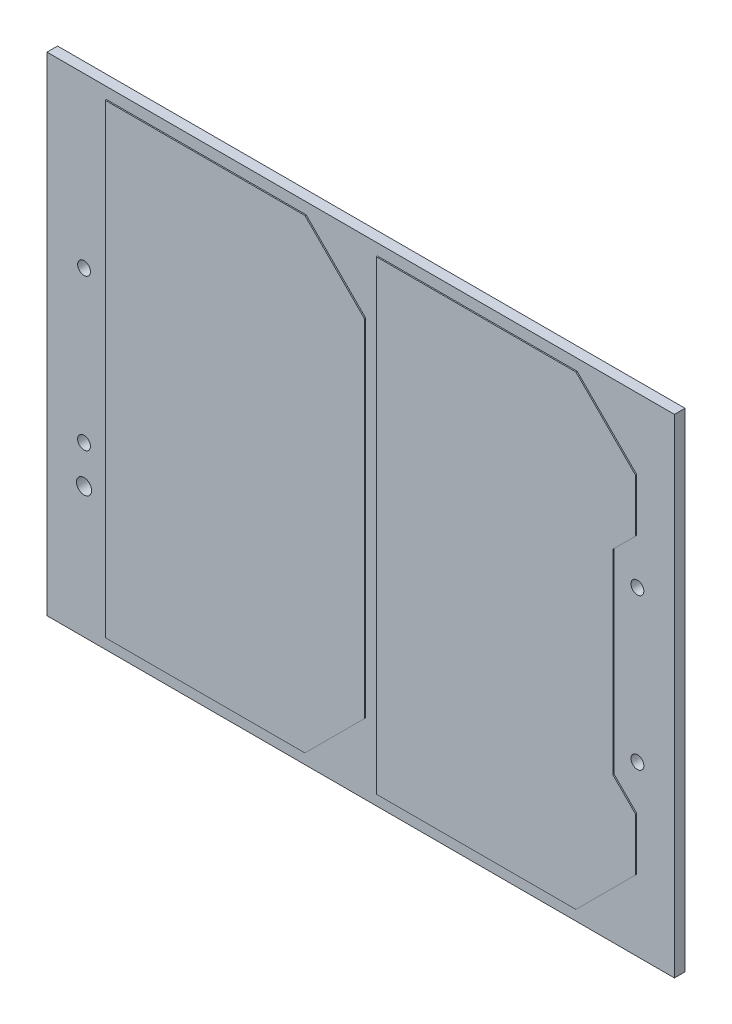
ISO-10303-21;
HEADER;
FILE_DESCRIPTION(('STEP AP214'),'2;1');
FILE_NAME('part.step','',(''),(''),'','','');
FILE_SCHEMA(('AUTOMOTIVE_DESIGN { 1 0 10303 214 1 1 1 1 }'));
ENDSEC;
DATA;
#1=APPLICATION_CONTEXT('core data for automotive mechanical design processes');
#2=APPLICATION_PROTOCOL_DEFINITION('international standard','automotive_design',2000,#1);
#3=PRODUCT_CONTEXT('',#1,'mechanical');
#4=PRODUCT('Part','Part','',(#3));
#5=PRODUCT_RELATED_PRODUCT_CATEGORY('part','',(#4));
#6=PRODUCT_DEFINITION_FORMATION('','',#4);
#7=PRODUCT_DEFINITION_CONTEXT('part definition',#1,'design');
#8=PRODUCT_DEFINITION('design','',#6,#7);
#9=PRODUCT_DEFINITION_SHAPE('','',#8);
#10=(LENGTH_UNIT() NAMED_UNIT(*) SI_UNIT(.MILLI.,.METRE.));
#11=(NAMED_UNIT(*) PLANE_ANGLE_UNIT() SI_UNIT($,.RADIAN.));
#12=(NAMED_UNIT(*) SI_UNIT($,.STERADIAN.) SOLID_ANGLE_UNIT());
#13=UNCERTAINTY_MEASURE_WITH_UNIT(LENGTH_MEASURE(1.E-05),#10,'distance_accuracy_value','');
#14=(GEOMETRIC_REPRESENTATION_CONTEXT(3) GLOBAL_UNCERTAINTY_ASSIGNED_CONTEXT((#13)) GLOBAL_UNIT_ASSIGNED_CONTEXT((#10,
#11,#12)) REPRESENTATION_CONTEXT('',''));
#15=CARTESIAN_POINT('',(0.,0.,0.));
#16=DIRECTION('',(0.,0.,1.));
#17=DIRECTION('',(1.,0.,0.));
#18=AXIS2_PLACEMENT_3D('',#15,#16,#17);
#19=CARTESIAN_POINT('',(0.,0.,1.778));
#20=DIRECTION('',(0.,0.,1.));
#21=DIRECTION('',(1.,0.,0.));
#22=AXIS2_PLACEMENT_3D('',#19,#20,#21);
#23=PLANE('',#22);
#24=CARTESIAN_POINT('',(-46.482,-19.05,1.778));
#25=DIRECTION('',(0.,0.,1.));
#26=DIRECTION('',(1.,0.,0.));
#27=AXIS2_PLACEMENT_3D('',#24,#25,#26);
#28=CIRCLE('',#27,1.27);
#29=CARTESIAN_POINT('',(-45.212,-19.05,1.778));
#30=VERTEX_POINT('',#29);
#31=EDGE_CURVE('E251',#30,#30,#28,.T.);
#32=ORIENTED_EDGE('',*,*,#31,.F.);
#33=EDGE_LOOP('',(#32));
#34=FACE_BOUND('',#33,.T.);
#35=CARTESIAN_POINT('',(-46.482,-12.7,1.778));
#36=DIRECTION('',(0.,0.,1.));
#37=DIRECTION('',(1.,0.,0.));
#38=AXIS2_PLACEMENT_3D('',#35,#36,#37);
#39=CIRCLE('',#38,1.0795);
#40=CARTESIAN_POINT('',(-45.4025,-12.7,1.778));
#41=VERTEX_POINT('',#40);
#42=EDGE_CURVE('E254',#41,#41,#39,.T.);
#43=ORIENTED_EDGE('',*,*,#42,.F.);
#44=EDGE_LOOP('',(#43));
#45=FACE_BOUND('',#44,.T.);
#46=CARTESIAN_POINT('',(-46.482,12.7,1.778));
#47=DIRECTION('',(0.,0.,1.));
#48=DIRECTION('',(1.,0.,0.));
#49=AXIS2_PLACEMENT_3D('',#46,#47,#48);
#50=CIRCLE('',#49,1.0795);
#51=CARTESIAN_POINT('',(-45.4025,12.7,1.778));
#52=VERTEX_POINT('',#51);
#53=EDGE_CURVE('E258',#52,#52,#50,.T.);
#54=ORIENTED_EDGE('',*,*,#53,.F.);
#55=EDGE_LOOP('',(#54));
#56=FACE_BOUND('',#55,.T.);
#57=CARTESIAN_POINT('',(46.482,-12.7,1.778));
#58=DIRECTION('',(0.,0.,1.));
#59=DIRECTION('',(1.,0.,0.));
#60=AXIS2_PLACEMENT_3D('',#57,#58,#59);
#61=CIRCLE('',#60,1.0795);
#62=CARTESIAN_POINT('',(47.5615,-12.7,1.778));
#63=VERTEX_POINT('',#62);
#64=EDGE_CURVE('E261',#63,#63,#61,.T.);
#65=ORIENTED_EDGE('',*,*,#64,.F.);
#66=EDGE_LOOP('',(#65));
#67=FACE_BOUND('',#66,.T.);
#68=CARTESIAN_POINT('',(46.482,12.7,1.778));
#69=DIRECTION('',(0.,0.,1.));
#70=DIRECTION('',(1.,0.,0.));
#71=AXIS2_PLACEMENT_3D('',#68,#69,#70);
#72=CIRCLE('',#71,1.0795);
#73=CARTESIAN_POINT('',(47.5615,12.7,1.778));
#74=VERTEX_POINT('',#73);
#75=EDGE_CURVE('E264',#74,#74,#72,.T.);
#76=ORIENTED_EDGE('',*,*,#75,.F.);
#77=EDGE_LOOP('',(#76));
#78=FACE_BOUND('',#77,.T.);
#79=DIRECTION('',(1.,0.,0.));
#80=VECTOR('',#79,1.);
#81=CARTESIAN_POINT('',(0.,-41.,1.778));
#82=LINE('',#81,#80);
#83=CARTESIAN_POINT('',(-52.705,-41.,1.778));
#84=VERTEX_POINT('',#83);
#85=CARTESIAN_POINT('',(52.705,-41.,1.778));
#86=VERTEX_POINT('',#85);
#87=EDGE_CURVE('E267',#84,#86,#82,.T.);
#88=ORIENTED_EDGE('',*,*,#87,.T.);
#89=DIRECTION('',(0.,1.,0.));
#90=VECTOR('',#89,1.);
#91=CARTESIAN_POINT('',(52.705,0.,1.778));
#92=LINE('',#91,#90);
#93=CARTESIAN_POINT('',(52.705,41.,1.778));
#94=VERTEX_POINT('',#93);
#95=EDGE_CURVE('E270',#86,#94,#92,.T.);
#96=ORIENTED_EDGE('',*,*,#95,.T.);
#97=DIRECTION('',(1.,0.,0.));
#98=VECTOR('',#97,1.);
#99=CARTESIAN_POINT('',(0.,41.,1.778));
#100=LINE('',#99,#98);
#101=CARTESIAN_POINT('',(-52.705,41.,1.778));
#102=VERTEX_POINT('',#101);
#103=EDGE_CURVE('E272',#102,#94,#100,.T.);
#104=ORIENTED_EDGE('',*,*,#103,.F.);
#105=DIRECTION('',(0.,1.,0.));
#106=VECTOR('',#105,1.);
#107=CARTESIAN_POINT('',(-52.705,0.,1.778));
#108=LINE('',#107,#106);
#109=EDGE_CURVE('E275',#84,#102,#108,.T.);
#110=ORIENTED_EDGE('',*,*,#109,.F.);
#111=EDGE_LOOP('',(#88,#96,#104,#110));
#112=FACE_BOUND('',#111,.T.);
#113=DIRECTION('',(1.,0.,0.));
#114=VECTOR('',#113,1.);
#115=CARTESIAN_POINT('',(-42.705,-39.095,1.778));
#116=LINE('',#115,#114);
#117=CARTESIAN_POINT('',(-42.705,-39.095,1.778));
#118=VERTEX_POINT('',#117);
#119=CARTESIAN_POINT('',(-9.17499999999998,-39.095,1.778));
#120=VERTEX_POINT('',#119);
#121=EDGE_CURVE('E207',#118,#120,#116,.T.);
#122=ORIENTED_EDGE('',*,*,#121,.F.);
#123=DIRECTION('',(0.,-1.,0.));
#124=VECTOR('',#123,1.);
#125=CARTESIAN_POINT('',(-42.705,39.095,1.778));
#126=LINE('',#125,#124);
#127=CARTESIAN_POINT('',(-42.705,39.095,1.778));
#128=VERTEX_POINT('',#127);
#129=EDGE_CURVE('E204',#128,#118,#126,.T.);
#130=ORIENTED_EDGE('',*,*,#129,.F.);
#131=DIRECTION('',(-1.,0.,0.));
#132=VECTOR('',#131,1.);
#133=CARTESIAN_POINT('',(-42.705,39.095,1.778));
#134=LINE('',#133,#132);
#135=CARTESIAN_POINT('',(-9.17499999999999,39.095,1.778));
#136=VERTEX_POINT('',#135);
#137=EDGE_CURVE('E217',#136,#128,#134,.T.);
#138=ORIENTED_EDGE('',*,*,#137,.F.);
#139=DIRECTION('',(-0.707106781186548,0.707106781186548,0.));
#140=VECTOR('',#139,1.);
#141=CARTESIAN_POINT('',(-9.17499999999999,39.095,1.778));
#142=LINE('',#141,#140);
#143=CARTESIAN_POINT('',(0.825000000000014,29.095,1.778));
#144=VERTEX_POINT('',#143);
#145=EDGE_CURVE('E233',#144,#136,#142,.T.);
#146=ORIENTED_EDGE('',*,*,#145,.F.);
#147=DIRECTION('',(0.,1.,0.));
#148=VECTOR('',#147,1.);
#149=CARTESIAN_POINT('',(0.825000000000014,29.095,1.778));
#150=LINE('',#149,#148);
#151=CARTESIAN_POINT('',(0.825000000000014,-29.095,1.778));
#152=VERTEX_POINT('',#151);
#153=EDGE_CURVE('E231',#152,#144,#150,.T.);
#154=ORIENTED_EDGE('',*,*,#153,.F.);
#155=DIRECTION('',(0.707106781186547,0.707106781186548,0.));
#156=VECTOR('',#155,1.);
#157=CARTESIAN_POINT('',(0.825000000000014,-29.095,1.778));
#158=LINE('',#157,#156);
#159=EDGE_CURVE('E229',#120,#152,#158,.T.);
#160=ORIENTED_EDGE('',*,*,#159,.F.);
#161=EDGE_LOOP('',(#122,#130,#138,#146,#154,#160));
#162=FACE_BOUND('',#161,.T.);
#163=DIRECTION('',(-0.707106781186548,0.707106781186547,0.));
#164=VECTOR('',#163,1.);
#165=CARTESIAN_POINT('',(36.355,39.095,1.778));
#166=LINE('',#165,#164);
#167=CARTESIAN_POINT('',(46.355,29.095,1.778));
#168=VERTEX_POINT('',#167);
#169=CARTESIAN_POINT('',(36.355,39.095,1.778));
#170=VERTEX_POINT('',#169);
#171=EDGE_CURVE('E602',#168,#170,#166,.T.);
#172=ORIENTED_EDGE('',*,*,#171,.F.);
#173=DIRECTION('',(0.,1.,0.));
#174=VECTOR('',#173,1.);
#175=CARTESIAN_POINT('',(46.355,29.095,1.778));
#176=LINE('',#175,#174);
#177=CARTESIAN_POINT('',(46.355,20.205,1.778));
#178=VERTEX_POINT('',#177);
#179=EDGE_CURVE('E202',#178,#168,#176,.T.);
#180=ORIENTED_EDGE('',*,*,#179,.F.);
#181=DIRECTION('',(0.707106781186549,0.707106781186546,0.));
#182=VECTOR('',#181,1.);
#183=CARTESIAN_POINT('',(46.355,20.205,1.778));
#184=LINE('',#183,#182);
#185=CARTESIAN_POINT('',(42.545,16.395,1.778));
#186=VERTEX_POINT('',#185);
#187=EDGE_CURVE('E198',#186,#178,#184,.T.);
#188=ORIENTED_EDGE('',*,*,#187,.F.);
#189=DIRECTION('',(0.,1.,0.));
#190=VECTOR('',#189,1.);
#191=CARTESIAN_POINT('',(42.545,16.395,1.778));
#192=LINE('',#191,#190);
#193=CARTESIAN_POINT('',(42.545,-16.395,1.778));
#194=VERTEX_POINT('',#193);
#195=EDGE_CURVE('E598',#194,#186,#192,.T.);
#196=ORIENTED_EDGE('',*,*,#195,.F.);
#197=DIRECTION('',(-0.707106781186548,0.707106781186547,0.));
#198=VECTOR('',#197,1.);
#199=CARTESIAN_POINT('',(42.545,-16.395,1.778));
#200=LINE('',#199,#198);
#201=CARTESIAN_POINT('',(46.355,-20.205,1.778));
#202=VERTEX_POINT('',#201);
#203=EDGE_CURVE('E618',#202,#194,#200,.T.);
#204=ORIENTED_EDGE('',*,*,#203,.F.);
#205=DIRECTION('',(0.,1.,0.));
#206=VECTOR('',#205,1.);
#207=CARTESIAN_POINT('',(46.355,-20.205,1.778));
#208=LINE('',#207,#206);
#209=CARTESIAN_POINT('',(46.355,-29.095,1.778));
#210=VERTEX_POINT('',#209);
#211=EDGE_CURVE('E616',#210,#202,#208,.T.);
#212=ORIENTED_EDGE('',*,*,#211,.F.);
#213=DIRECTION('',(0.707106781186548,0.707106781186547,0.));
#214=VECTOR('',#213,1.);
#215=CARTESIAN_POINT('',(36.355,-39.095,1.778));
#216=LINE('',#215,#214);
#217=CARTESIAN_POINT('',(36.355,-39.095,1.778));
#218=VERTEX_POINT('',#217);
#219=EDGE_CURVE('E614',#218,#210,#216,.T.);
#220=ORIENTED_EDGE('',*,*,#219,.F.);
#221=DIRECTION('',(1.,0.,0.));
#222=VECTOR('',#221,1.);
#223=CARTESIAN_POINT('',(2.82500000000001,-39.095,1.778));
#224=LINE('',#223,#222);
#225=CARTESIAN_POINT('',(2.82500000000001,-39.095,1.778));
#226=VERTEX_POINT('',#225);
#227=EDGE_CURVE('E612',#226,#218,#224,.T.);
#228=ORIENTED_EDGE('',*,*,#227,.F.);
#229=DIRECTION('',(0.,-1.,0.));
#230=VECTOR('',#229,1.);
#231=CARTESIAN_POINT('',(2.82500000000001,39.095,1.778));
#232=LINE('',#231,#230);
#233=CARTESIAN_POINT('',(2.82500000000001,39.095,1.778));
#234=VERTEX_POINT('',#233);
#235=EDGE_CURVE('E610',#234,#226,#232,.T.);
#236=ORIENTED_EDGE('',*,*,#235,.F.);
#237=DIRECTION('',(-1.,0.,0.));
#238=VECTOR('',#237,1.);
#239=CARTESIAN_POINT('',(2.82500000000001,39.095,1.778));
#240=LINE('',#239,#238);
#241=EDGE_CURVE('E604',#170,#234,#240,.T.);
#242=ORIENTED_EDGE('',*,*,#241,.F.);
#243=EDGE_LOOP('',(#172,#180,#188,#196,#204,#212,#220,#228,#236,#242));
#244=FACE_BOUND('',#243,.T.);
#245=ADVANCED_FACE('F41',(#34,#45,#56,#67,#78,#112,#162,#244),#23,.T.);
#246=CARTESIAN_POINT('',(0.,-41.,1.778));
#247=DIRECTION('',(0.,1.,0.));
#248=DIRECTION('',(0.,0.,1.));
#249=AXIS2_PLACEMENT_3D('',#246,#247,#248);
#250=PLANE('',#249);
#251=DIRECTION('',(1.,0.,0.));
#252=VECTOR('',#251,1.);
#253=CARTESIAN_POINT('',(0.,-41.,0.));
#254=LINE('',#253,#252);
#255=CARTESIAN_POINT('',(-52.705,-41.,0.));
#256=VERTEX_POINT('',#255);
#257=CARTESIAN_POINT('',(52.705,-41.,0.));
#258=VERTEX_POINT('',#257);
#259=EDGE_CURVE('E293',#256,#258,#254,.T.);
#260=ORIENTED_EDGE('',*,*,#259,.T.);
#261=DIRECTION('',(0.,0.,-1.));
#262=VECTOR('',#261,1.);
#263=CARTESIAN_POINT('',(52.705,-41.,1.778));
#264=LINE('',#263,#262);
#265=EDGE_CURVE('E11',#86,#258,#264,.T.);
#266=ORIENTED_EDGE('',*,*,#265,.F.);
#267=ORIENTED_EDGE('',*,*,#87,.F.);
#268=DIRECTION('',(0.,0.,-1.));
#269=VECTOR('',#268,1.);
#270=CARTESIAN_POINT('',(-52.705,-41.,1.778));
#271=LINE('',#270,#269);
#272=EDGE_CURVE('E278',#84,#256,#271,.T.);
#273=ORIENTED_EDGE('',*,*,#272,.T.);
#274=EDGE_LOOP('',(#260,#266,#267,#273));
#275=FACE_BOUND('',#274,.T.);
#276=ADVANCED_FACE('F325',(#275),#250,.F.);
#277=CARTESIAN_POINT('',(52.705,0.,1.778));
#278=DIRECTION('',(-1.,0.,0.));
#279=DIRECTION('',(0.,0.,1.));
#280=AXIS2_PLACEMENT_3D('',#277,#278,#279);
#281=PLANE('',#280);
#282=DIRECTION('',(0.,1.,0.));
#283=VECTOR('',#282,1.);
#284=CARTESIAN_POINT('',(52.705,0.,0.));
#285=LINE('',#284,#283);
#286=CARTESIAN_POINT('',(52.705,41.,0.));
#287=VERTEX_POINT('',#286);
#288=EDGE_CURVE('E296',#258,#287,#285,.T.);
#289=ORIENTED_EDGE('',*,*,#288,.T.);
#290=DIRECTION('',(0.,0.,-1.));
#291=VECTOR('',#290,1.);
#292=CARTESIAN_POINT('',(52.705,41.,1.778));
#293=LINE('',#292,#291);
#294=EDGE_CURVE('E49',#94,#287,#293,.T.);
#295=ORIENTED_EDGE('',*,*,#294,.F.);
#296=ORIENTED_EDGE('',*,*,#95,.F.);
#297=ORIENTED_EDGE('',*,*,#265,.T.);
#298=EDGE_LOOP('',(#289,#295,#296,#297));
#299=FACE_BOUND('',#298,.T.);
#300=ADVANCED_FACE('F312',(#299),#281,.F.);
#301=CARTESIAN_POINT('',(0.,41.,1.778));
#302=DIRECTION('',(0.,1.,0.));
#303=DIRECTION('',(0.,0.,1.));
#304=AXIS2_PLACEMENT_3D('',#301,#302,#303);
#305=PLANE('',#304);
#306=DIRECTION('',(1.,0.,0.));
#307=VECTOR('',#306,1.);
#308=CARTESIAN_POINT('',(0.,41.,0.));
#309=LINE('',#308,#307);
#310=CARTESIAN_POINT('',(-52.705,41.,0.));
#311=VERTEX_POINT('',#310);
#312=EDGE_CURVE('E299',#311,#287,#309,.T.);
#313=ORIENTED_EDGE('',*,*,#312,.F.);
#314=DIRECTION('',(0.,0.,-1.));
#315=VECTOR('',#314,1.);
#316=CARTESIAN_POINT('',(-52.705,41.,1.778));
#317=LINE('',#316,#315);
#318=EDGE_CURVE('E305',#102,#311,#317,.T.);
#319=ORIENTED_EDGE('',*,*,#318,.F.);
#320=ORIENTED_EDGE('',*,*,#103,.T.);
#321=ORIENTED_EDGE('',*,*,#294,.T.);
#322=EDGE_LOOP('',(#313,#319,#320,#321));
#323=FACE_BOUND('',#322,.T.);
#324=ADVANCED_FACE('F309',(#323),#305,.T.);
#325=CARTESIAN_POINT('',(46.482,12.7,1.778));
#326=DIRECTION('',(0.,0.,-1.));
#327=DIRECTION('',(-1.,0.,0.));
#328=AXIS2_PLACEMENT_3D('',#325,#326,#327);
#329=CYLINDRICAL_SURFACE('',#328,1.0795);
#330=ORIENTED_EDGE('',*,*,#75,.T.);
#331=EDGE_LOOP('',(#330));
#332=FACE_BOUND('',#331,.T.);
#333=CARTESIAN_POINT('',(46.482,12.7,0.));
#334=DIRECTION('',(0.,0.,1.));
#335=DIRECTION('',(1.,0.,0.));
#336=AXIS2_PLACEMENT_3D('',#333,#334,#335);
#337=CIRCLE('',#336,1.0795);
#338=CARTESIAN_POINT('',(47.5615,12.7,0.));
#339=VERTEX_POINT('',#338);
#340=EDGE_CURVE('E290',#339,#339,#337,.T.);
#341=ORIENTED_EDGE('',*,*,#340,.F.);
#342=EDGE_LOOP('',(#341));
#343=FACE_BOUND('',#342,.T.);
#344=ADVANCED_FACE('F337',(#332,#343),#329,.F.);
#345=CARTESIAN_POINT('',(46.482,-12.7,1.778));
#346=DIRECTION('',(0.,0.,-1.));
#347=DIRECTION('',(-1.,0.,0.));
#348=AXIS2_PLACEMENT_3D('',#345,#346,#347);
#349=CYLINDRICAL_SURFACE('',#348,1.0795);
#350=ORIENTED_EDGE('',*,*,#64,.T.);
#351=EDGE_LOOP('',(#350));
#352=FACE_BOUND('',#351,.T.);
#353=CARTESIAN_POINT('',(46.482,-12.7,0.));
#354=DIRECTION('',(0.,0.,1.));
#355=DIRECTION('',(1.,0.,0.));
#356=AXIS2_PLACEMENT_3D('',#353,#354,#355);
#357=CIRCLE('',#356,1.0795);
#358=CARTESIAN_POINT('',(47.5615,-12.7,0.));
#359=VERTEX_POINT('',#358);
#360=EDGE_CURVE('E287',#359,#359,#357,.T.);
#361=ORIENTED_EDGE('',*,*,#360,.F.);
#362=EDGE_LOOP('',(#361));
#363=FACE_BOUND('',#362,.T.);
#364=ADVANCED_FACE('F340',(#352,#363),#349,.F.);
#365=CARTESIAN_POINT('',(-46.482,12.7,1.778));
#366=DIRECTION('',(0.,0.,-1.));
#367=DIRECTION('',(-1.,0.,0.));
#368=AXIS2_PLACEMENT_3D('',#365,#366,#367);
#369=CYLINDRICAL_SURFACE('',#368,1.0795);
#370=ORIENTED_EDGE('',*,*,#53,.T.);
#371=EDGE_LOOP('',(#370));
#372=FACE_BOUND('',#371,.T.);
#373=CARTESIAN_POINT('',(-46.482,12.7,0.));
#374=DIRECTION('',(0.,0.,1.));
#375=DIRECTION('',(1.,0.,0.));
#376=AXIS2_PLACEMENT_3D('',#373,#374,#375);
#377=CIRCLE('',#376,1.0795);
#378=CARTESIAN_POINT('',(-45.4025,12.7,0.));
#379=VERTEX_POINT('',#378);
#380=EDGE_CURVE('E284',#379,#379,#377,.T.);
#381=ORIENTED_EDGE('',*,*,#380,.F.);
#382=EDGE_LOOP('',(#381));
#383=FACE_BOUND('',#382,.T.);
#384=ADVANCED_FACE('F344',(#372,#383),#369,.F.);
#385=CARTESIAN_POINT('',(-46.482,-12.7,1.778));
#386=DIRECTION('',(0.,0.,-1.));
#387=DIRECTION('',(-1.,0.,0.));
#388=AXIS2_PLACEMENT_3D('',#385,#386,#387);
#389=CYLINDRICAL_SURFACE('',#388,1.0795);
#390=ORIENTED_EDGE('',*,*,#42,.T.);
#391=EDGE_LOOP('',(#390));
#392=FACE_BOUND('',#391,.T.);
#393=CARTESIAN_POINT('',(-46.482,-12.7,0.));
#394=DIRECTION('',(0.,0.,1.));
#395=DIRECTION('',(1.,0.,0.));
#396=AXIS2_PLACEMENT_3D('',#393,#394,#395);
#397=CIRCLE('',#396,1.0795);
#398=CARTESIAN_POINT('',(-45.4025,-12.7,0.));
#399=VERTEX_POINT('',#398);
#400=EDGE_CURVE('E281',#399,#399,#397,.T.);
#401=ORIENTED_EDGE('',*,*,#400,.F.);
#402=EDGE_LOOP('',(#401));
#403=FACE_BOUND('',#402,.T.);
#404=ADVANCED_FACE('F347',(#392,#403),#389,.F.);
#405=CARTESIAN_POINT('',(-46.482,-19.05,1.778));
#406=DIRECTION('',(0.,0.,-1.));
#407=DIRECTION('',(-1.,0.,0.));
#408=AXIS2_PLACEMENT_3D('',#405,#406,#407);
#409=CYLINDRICAL_SURFACE('',#408,1.27);
#410=ORIENTED_EDGE('',*,*,#31,.T.);
#411=EDGE_LOOP('',(#410));
#412=FACE_BOUND('',#411,.T.);
#413=CARTESIAN_POINT('',(-46.482,-19.05,0.));
#414=DIRECTION('',(0.,0.,1.));
#415=DIRECTION('',(1.,0.,0.));
#416=AXIS2_PLACEMENT_3D('',#413,#414,#415);
#417=CIRCLE('',#416,1.27);
#418=CARTESIAN_POINT('',(-45.212,-19.05,0.));
#419=VERTEX_POINT('',#418);
#420=EDGE_CURVE('E250',#419,#419,#417,.T.);
#421=ORIENTED_EDGE('',*,*,#420,.F.);
#422=EDGE_LOOP('',(#421));
#423=FACE_BOUND('',#422,.T.);
#424=ADVANCED_FACE('F43',(#412,#423),#409,.F.);
#425=CARTESIAN_POINT('',(-52.705,0.,1.778));
#426=DIRECTION('',(-1.,0.,0.));
#427=DIRECTION('',(0.,0.,1.));
#428=AXIS2_PLACEMENT_3D('',#425,#426,#427);
#429=PLANE('',#428);
#430=DIRECTION('',(0.,1.,0.));
#431=VECTOR('',#430,1.);
#432=CARTESIAN_POINT('',(-52.705,0.,0.));
#433=LINE('',#432,#431);
#434=EDGE_CURVE('E255',#256,#311,#433,.T.);
#435=ORIENTED_EDGE('',*,*,#434,.F.);
#436=ORIENTED_EDGE('',*,*,#272,.F.);
#437=ORIENTED_EDGE('',*,*,#109,.T.);
#438=ORIENTED_EDGE('',*,*,#318,.T.);
#439=EDGE_LOOP('',(#435,#436,#437,#438));
#440=FACE_BOUND('',#439,.T.);
#441=ADVANCED_FACE('F319',(#440),#429,.T.);
#442=CARTESIAN_POINT('',(0.,0.,0.));
#443=DIRECTION('',(0.,0.,1.));
#444=DIRECTION('',(1.,0.,0.));
#445=AXIS2_PLACEMENT_3D('',#442,#443,#444);
#446=PLANE('',#445);
#447=ORIENTED_EDGE('',*,*,#420,.T.);
#448=EDGE_LOOP('',(#447));
#449=FACE_BOUND('',#448,.T.);
#450=ORIENTED_EDGE('',*,*,#400,.T.);
#451=EDGE_LOOP('',(#450));
#452=FACE_BOUND('',#451,.T.);
#453=ORIENTED_EDGE('',*,*,#380,.T.);
#454=EDGE_LOOP('',(#453));
#455=FACE_BOUND('',#454,.T.);
#456=ORIENTED_EDGE('',*,*,#360,.T.);
#457=EDGE_LOOP('',(#456));
#458=FACE_BOUND('',#457,.T.);
#459=ORIENTED_EDGE('',*,*,#340,.T.);
#460=EDGE_LOOP('',(#459));
#461=FACE_BOUND('',#460,.T.);
#462=ORIENTED_EDGE('',*,*,#259,.F.);
#463=ORIENTED_EDGE('',*,*,#434,.T.);
#464=ORIENTED_EDGE('',*,*,#312,.T.);
#465=ORIENTED_EDGE('',*,*,#288,.F.);
#466=EDGE_LOOP('',(#462,#463,#464,#465));
#467=FACE_BOUND('',#466,.T.);
#468=ADVANCED_FACE('F316',(#449,#452,#455,#458,#461,#467),#446,.F.);
#469=CARTESIAN_POINT('',(-42.705,39.095,1.978));
#470=DIRECTION('',(1.,0.,0.));
#471=DIRECTION('',(0.,0.,-1.));
#472=AXIS2_PLACEMENT_3D('',#469,#470,#471);
#473=PLANE('',#472);
#474=ORIENTED_EDGE('',*,*,#129,.T.);
#475=DIRECTION('',(0.,0.,-1.));
#476=VECTOR('',#475,1.);
#477=CARTESIAN_POINT('',(-42.705,-39.095,1.978));
#478=LINE('',#477,#476);
#479=CARTESIAN_POINT('',(-42.705,-39.095,1.978));
#480=VERTEX_POINT('',#479);
#481=EDGE_CURVE('E248',#480,#118,#478,.T.);
#482=ORIENTED_EDGE('',*,*,#481,.F.);
#483=DIRECTION('',(0.,-1.,0.));
#484=VECTOR('',#483,1.);
#485=CARTESIAN_POINT('',(-42.705,39.095,1.978));
#486=LINE('',#485,#484);
#487=CARTESIAN_POINT('',(-42.705,39.095,1.978));
#488=VERTEX_POINT('',#487);
#489=EDGE_CURVE('E213',#488,#480,#486,.T.);
#490=ORIENTED_EDGE('',*,*,#489,.F.);
#491=DIRECTION('',(0.,0.,-1.));
#492=VECTOR('',#491,1.);
#493=CARTESIAN_POINT('',(-42.705,39.095,1.978));
#494=LINE('',#493,#492);
#495=EDGE_CURVE('E226',#488,#128,#494,.T.);
#496=ORIENTED_EDGE('',*,*,#495,.T.);
#497=EDGE_LOOP('',(#474,#482,#490,#496));
#498=FACE_BOUND('',#497,.T.);
#499=ADVANCED_FACE('F361',(#498),#473,.F.);
#500=CARTESIAN_POINT('',(-42.705,-39.095,1.978));
#501=DIRECTION('',(0.,1.,0.));
#502=DIRECTION('',(0.,0.,1.));
#503=AXIS2_PLACEMENT_3D('',#500,#501,#502);
#504=PLANE('',#503);
#505=ORIENTED_EDGE('',*,*,#121,.T.);
#506=DIRECTION('',(0.,0.,-1.));
#507=VECTOR('',#506,1.);
#508=CARTESIAN_POINT('',(-9.17499999999998,-39.095,1.978));
#509=LINE('',#508,#507);
#510=CARTESIAN_POINT('',(-9.17499999999998,-39.095,1.978));
#511=VERTEX_POINT('',#510);
#512=EDGE_CURVE('E245',#511,#120,#509,.T.);
#513=ORIENTED_EDGE('',*,*,#512,.F.);
#514=DIRECTION('',(1.,0.,0.));
#515=VECTOR('',#514,1.);
#516=CARTESIAN_POINT('',(-42.705,-39.095,1.978));
#517=LINE('',#516,#515);
#518=EDGE_CURVE('E216',#480,#511,#517,.T.);
#519=ORIENTED_EDGE('',*,*,#518,.F.);
#520=ORIENTED_EDGE('',*,*,#481,.T.);
#521=EDGE_LOOP('',(#505,#513,#519,#520));
#522=FACE_BOUND('',#521,.T.);
#523=ADVANCED_FACE('F376',(#522),#504,.F.);
#524=CARTESIAN_POINT('',(0.825000000000014,-29.095,1.978));
#525=DIRECTION('',(-0.707106781186548,0.707106781186548,0.));
#526=DIRECTION('',(-0.707106781186547,-0.707106781186548,0.));
#527=AXIS2_PLACEMENT_3D('',#524,#525,#526);
#528=PLANE('',#527);
#529=ORIENTED_EDGE('',*,*,#159,.T.);
#530=DIRECTION('',(0.,0.,-1.));
#531=VECTOR('',#530,1.);
#532=CARTESIAN_POINT('',(0.825000000000014,-29.095,1.978));
#533=LINE('',#532,#531);
#534=CARTESIAN_POINT('',(0.825000000000014,-29.095,1.978));
#535=VERTEX_POINT('',#534);
#536=EDGE_CURVE('E242',#535,#152,#533,.T.);
#537=ORIENTED_EDGE('',*,*,#536,.F.);
#538=DIRECTION('',(0.707106781186547,0.707106781186548,0.));
#539=VECTOR('',#538,1.);
#540=CARTESIAN_POINT('',(0.825000000000014,-29.095,1.978));
#541=LINE('',#540,#539);
#542=EDGE_CURVE('E219',#511,#535,#541,.T.);
#543=ORIENTED_EDGE('',*,*,#542,.F.);
#544=ORIENTED_EDGE('',*,*,#512,.T.);
#545=EDGE_LOOP('',(#529,#537,#543,#544));
#546=FACE_BOUND('',#545,.T.);
#547=ADVANCED_FACE('F438',(#546),#528,.F.);
#548=CARTESIAN_POINT('',(0.825000000000014,29.095,1.978));
#549=DIRECTION('',(-1.,0.,0.));
#550=DIRECTION('',(0.,0.,1.));
#551=AXIS2_PLACEMENT_3D('',#548,#549,#550);
#552=PLANE('',#551);
#553=ORIENTED_EDGE('',*,*,#153,.T.);
#554=DIRECTION('',(0.,0.,-1.));
#555=VECTOR('',#554,1.);
#556=CARTESIAN_POINT('',(0.825000000000014,29.095,1.978));
#557=LINE('',#556,#555);
#558=CARTESIAN_POINT('',(0.825000000000014,29.095,1.978));
#559=VERTEX_POINT('',#558);
#560=EDGE_CURVE('E239',#559,#144,#557,.T.);
#561=ORIENTED_EDGE('',*,*,#560,.F.);
#562=DIRECTION('',(0.,1.,0.));
#563=VECTOR('',#562,1.);
#564=CARTESIAN_POINT('',(0.825000000000014,29.095,1.978));
#565=LINE('',#564,#563);
#566=EDGE_CURVE('E221',#535,#559,#565,.T.);
#567=ORIENTED_EDGE('',*,*,#566,.F.);
#568=ORIENTED_EDGE('',*,*,#536,.T.);
#569=EDGE_LOOP('',(#553,#561,#567,#568));
#570=FACE_BOUND('',#569,.T.);
#571=ADVANCED_FACE('F448',(#570),#552,.F.);
#572=CARTESIAN_POINT('',(-9.17499999999999,39.095,1.978));
#573=DIRECTION('',(-0.707106781186548,-0.707106781186548,0.));
#574=DIRECTION('',(0.707106781186548,-0.707106781186548,0.));
#575=AXIS2_PLACEMENT_3D('',#572,#573,#574);
#576=PLANE('',#575);
#577=ORIENTED_EDGE('',*,*,#145,.T.);
#578=DIRECTION('',(0.,0.,-1.));
#579=VECTOR('',#578,1.);
#580=CARTESIAN_POINT('',(-9.17499999999999,39.095,1.978));
#581=LINE('',#580,#579);
#582=CARTESIAN_POINT('',(-9.17499999999999,39.095,1.978));
#583=VERTEX_POINT('',#582);
#584=EDGE_CURVE('E64',#583,#136,#581,.T.);
#585=ORIENTED_EDGE('',*,*,#584,.F.);
#586=DIRECTION('',(-0.707106781186548,0.707106781186548,0.));
#587=VECTOR('',#586,1.);
#588=CARTESIAN_POINT('',(-9.17499999999999,39.095,1.978));
#589=LINE('',#588,#587);
#590=EDGE_CURVE('E223',#559,#583,#589,.T.);
#591=ORIENTED_EDGE('',*,*,#590,.F.);
#592=ORIENTED_EDGE('',*,*,#560,.T.);
#593=EDGE_LOOP('',(#577,#585,#591,#592));
#594=FACE_BOUND('',#593,.T.);
#595=ADVANCED_FACE('F458',(#594),#576,.F.);
#596=CARTESIAN_POINT('',(-42.705,39.095,1.978));
#597=DIRECTION('',(0.,-1.,0.));
#598=DIRECTION('',(0.,0.,-1.));
#599=AXIS2_PLACEMENT_3D('',#596,#597,#598);
#600=PLANE('',#599);
#601=ORIENTED_EDGE('',*,*,#137,.T.);
#602=ORIENTED_EDGE('',*,*,#495,.F.);
#603=DIRECTION('',(-1.,0.,0.));
#604=VECTOR('',#603,1.);
#605=CARTESIAN_POINT('',(-42.705,39.095,1.978));
#606=LINE('',#605,#604);
#607=EDGE_CURVE('E225',#583,#488,#606,.T.);
#608=ORIENTED_EDGE('',*,*,#607,.F.);
#609=ORIENTED_EDGE('',*,*,#584,.T.);
#610=EDGE_LOOP('',(#601,#602,#608,#609));
#611=FACE_BOUND('',#610,.T.);
#612=ADVANCED_FACE('F468',(#611),#600,.F.);
#613=CARTESIAN_POINT('',(0.,0.,1.978));
#614=DIRECTION('',(0.,0.,1.));
#615=DIRECTION('',(1.,0.,0.));
#616=AXIS2_PLACEMENT_3D('',#613,#614,#615);
#617=PLANE('',#616);
#618=ORIENTED_EDGE('',*,*,#489,.T.);
#619=ORIENTED_EDGE('',*,*,#518,.T.);
#620=ORIENTED_EDGE('',*,*,#542,.T.);
#621=ORIENTED_EDGE('',*,*,#566,.T.);
#622=ORIENTED_EDGE('',*,*,#590,.T.);
#623=ORIENTED_EDGE('',*,*,#607,.T.);
#624=EDGE_LOOP('',(#618,#619,#620,#621,#622,#623));
#625=FACE_BOUND('',#624,.T.);
#626=ADVANCED_FACE('F478',(#625),#617,.T.);
#627=CARTESIAN_POINT('',(46.355,29.095,1.978));
#628=DIRECTION('',(-1.,0.,0.));
#629=DIRECTION('',(0.,-1.,0.));
#630=AXIS2_PLACEMENT_3D('',#627,#628,#629);
#631=PLANE('',#630);
#632=ORIENTED_EDGE('',*,*,#179,.T.);
#633=DIRECTION('',(0.,0.,-1.));
#634=VECTOR('',#633,1.);
#635=CARTESIAN_POINT('',(46.355,29.095,1.978));
#636=LINE('',#635,#634);
#637=CARTESIAN_POINT('',(46.355,29.095,1.978));
#638=VERTEX_POINT('',#637);
#639=EDGE_CURVE('E183',#638,#168,#636,.T.);
#640=ORIENTED_EDGE('',*,*,#639,.F.);
#641=DIRECTION('',(0.,1.,0.));
#642=VECTOR('',#641,1.);
#643=CARTESIAN_POINT('',(46.355,29.095,1.978));
#644=LINE('',#643,#642);
#645=CARTESIAN_POINT('',(46.355,20.205,1.978));
#646=VERTEX_POINT('',#645);
#647=EDGE_CURVE('E190',#646,#638,#644,.T.);
#648=ORIENTED_EDGE('',*,*,#647,.F.);
#649=DIRECTION('',(0.,0.,-1.));
#650=VECTOR('',#649,1.);
#651=CARTESIAN_POINT('',(46.355,20.205,1.978));
#652=LINE('',#651,#650);
#653=EDGE_CURVE('E595',#646,#178,#652,.T.);
#654=ORIENTED_EDGE('',*,*,#653,.T.);
#655=EDGE_LOOP('',(#632,#640,#648,#654));
#656=FACE_BOUND('',#655,.T.);
#657=ADVANCED_FACE('F200',(#656),#631,.F.);
#658=CARTESIAN_POINT('',(36.355,39.095,1.978));
#659=DIRECTION('',(-0.707106781186547,-0.707106781186548,0.));
#660=DIRECTION('',(0.707106781186548,-0.707106781186547,0.));
#661=AXIS2_PLACEMENT_3D('',#658,#659,#660);
#662=PLANE('',#661);
#663=ORIENTED_EDGE('',*,*,#171,.T.);
#664=DIRECTION('',(0.,0.,-1.));
#665=VECTOR('',#664,1.);
#666=CARTESIAN_POINT('',(36.355,39.095,1.978));
#667=LINE('',#666,#665);
#668=CARTESIAN_POINT('',(36.355,39.095,1.978));
#669=VERTEX_POINT('',#668);
#670=EDGE_CURVE('E186',#669,#170,#667,.T.);
#671=ORIENTED_EDGE('',*,*,#670,.F.);
#672=DIRECTION('',(-0.707106781186548,0.707106781186547,0.));
#673=VECTOR('',#672,1.);
#674=CARTESIAN_POINT('',(36.355,39.095,1.978));
#675=LINE('',#674,#673);
#676=EDGE_CURVE('E179',#638,#669,#675,.T.);
#677=ORIENTED_EDGE('',*,*,#676,.F.);
#678=ORIENTED_EDGE('',*,*,#639,.T.);
#679=EDGE_LOOP('',(#663,#671,#677,#678));
#680=FACE_BOUND('',#679,.T.);
#681=ADVANCED_FACE('F181',(#680),#662,.F.);
#682=CARTESIAN_POINT('',(2.82500000000001,39.095,1.978));
#683=DIRECTION('',(0.,-1.,0.));
#684=DIRECTION('',(1.,0.,0.));
#685=AXIS2_PLACEMENT_3D('',#682,#683,#684);
#686=PLANE('',#685);
#687=ORIENTED_EDGE('',*,*,#241,.T.);
#688=DIRECTION('',(0.,0.,-1.));
#689=VECTOR('',#688,1.);
#690=CARTESIAN_POINT('',(2.82500000000001,39.095,1.978));
#691=LINE('',#690,#689);
#692=CARTESIAN_POINT('',(2.82500000000001,39.095,1.978));
#693=VERTEX_POINT('',#692);
#694=EDGE_CURVE('E209',#693,#234,#691,.T.);
#695=ORIENTED_EDGE('',*,*,#694,.F.);
#696=DIRECTION('',(-1.,0.,0.));
#697=VECTOR('',#696,1.);
#698=CARTESIAN_POINT('',(2.82500000000001,39.095,1.978));
#699=LINE('',#698,#697);
#700=EDGE_CURVE('E189',#669,#693,#699,.T.);
#701=ORIENTED_EDGE('',*,*,#700,.F.);
#702=ORIENTED_EDGE('',*,*,#670,.T.);
#703=EDGE_LOOP('',(#687,#695,#701,#702));
#704=FACE_BOUND('',#703,.T.);
#705=ADVANCED_FACE('F504',(#704),#686,.F.);
#706=CARTESIAN_POINT('',(2.82500000000001,39.095,1.978));
#707=DIRECTION('',(1.,0.,0.));
#708=DIRECTION('',(0.,1.,0.));
#709=AXIS2_PLACEMENT_3D('',#706,#707,#708);
#710=PLANE('',#709);
#711=ORIENTED_EDGE('',*,*,#235,.T.);
#712=DIRECTION('',(0.,0.,-1.));
#713=VECTOR('',#712,1.);
#714=CARTESIAN_POINT('',(2.82500000000001,-39.095,1.978));
#715=LINE('',#714,#713);
#716=CARTESIAN_POINT('',(2.82500000000001,-39.095,1.978));
#717=VERTEX_POINT('',#716);
#718=EDGE_CURVE('E634',#717,#226,#715,.T.);
#719=ORIENTED_EDGE('',*,*,#718,.F.);
#720=DIRECTION('',(0.,-1.,0.));
#721=VECTOR('',#720,1.);
#722=CARTESIAN_POINT('',(2.82500000000001,39.095,1.978));
#723=LINE('',#722,#721);
#724=EDGE_CURVE('E641',#693,#717,#723,.T.);
#725=ORIENTED_EDGE('',*,*,#724,.F.);
#726=ORIENTED_EDGE('',*,*,#694,.T.);
#727=EDGE_LOOP('',(#711,#719,#725,#726));
#728=FACE_BOUND('',#727,.T.);
#729=ADVANCED_FACE('F513',(#728),#710,.F.);
#730=CARTESIAN_POINT('',(2.82500000000001,-39.095,1.978));
#731=DIRECTION('',(0.,1.,0.));
#732=DIRECTION('',(0.,0.,1.));
#733=AXIS2_PLACEMENT_3D('',#730,#731,#732);
#734=PLANE('',#733);
#735=ORIENTED_EDGE('',*,*,#227,.T.);
#736=DIRECTION('',(0.,0.,-1.));
#737=VECTOR('',#736,1.);
#738=CARTESIAN_POINT('',(36.355,-39.095,1.978));
#739=LINE('',#738,#737);
#740=CARTESIAN_POINT('',(36.355,-39.095,1.978));
#741=VERTEX_POINT('',#740);
#742=EDGE_CURVE('E631',#741,#218,#739,.T.);
#743=ORIENTED_EDGE('',*,*,#742,.F.);
#744=DIRECTION('',(1.,0.,0.));
#745=VECTOR('',#744,1.);
#746=CARTESIAN_POINT('',(2.82500000000001,-39.095,1.978));
#747=LINE('',#746,#745);
#748=EDGE_CURVE('E652',#717,#741,#747,.T.);
#749=ORIENTED_EDGE('',*,*,#748,.F.);
#750=ORIENTED_EDGE('',*,*,#718,.T.);
#751=EDGE_LOOP('',(#735,#743,#749,#750));
#752=FACE_BOUND('',#751,.T.);
#753=ADVANCED_FACE('F523',(#752),#734,.F.);
#754=CARTESIAN_POINT('',(36.355,-39.095,1.978));
#755=DIRECTION('',(-0.707106781186547,0.707106781186548,0.));
#756=DIRECTION('',(-0.707106781186548,-0.707106781186547,0.));
#757=AXIS2_PLACEMENT_3D('',#754,#755,#756);
#758=PLANE('',#757);
#759=ORIENTED_EDGE('',*,*,#219,.T.);
#760=DIRECTION('',(0.,0.,-1.));
#761=VECTOR('',#760,1.);
#762=CARTESIAN_POINT('',(46.355,-29.095,1.978));
#763=LINE('',#762,#761);
#764=CARTESIAN_POINT('',(46.355,-29.095,1.978));
#765=VERTEX_POINT('',#764);
#766=EDGE_CURVE('E628',#765,#210,#763,.T.);
#767=ORIENTED_EDGE('',*,*,#766,.F.);
#768=DIRECTION('',(0.707106781186548,0.707106781186547,0.));
#769=VECTOR('',#768,1.);
#770=CARTESIAN_POINT('',(36.355,-39.095,1.978));
#771=LINE('',#770,#769);
#772=EDGE_CURVE('E649',#741,#765,#771,.T.);
#773=ORIENTED_EDGE('',*,*,#772,.F.);
#774=ORIENTED_EDGE('',*,*,#742,.T.);
#775=EDGE_LOOP('',(#759,#767,#773,#774));
#776=FACE_BOUND('',#775,.T.);
#777=ADVANCED_FACE('F533',(#776),#758,.F.);
#778=CARTESIAN_POINT('',(46.355,-20.205,1.978));
#779=DIRECTION('',(-1.,0.,0.));
#780=DIRECTION('',(0.,-1.,0.));
#781=AXIS2_PLACEMENT_3D('',#778,#779,#780);
#782=PLANE('',#781);
#783=ORIENTED_EDGE('',*,*,#211,.T.);
#784=DIRECTION('',(0.,0.,-1.));
#785=VECTOR('',#784,1.);
#786=CARTESIAN_POINT('',(46.355,-20.205,1.978));
#787=LINE('',#786,#785);
#788=CARTESIAN_POINT('',(46.355,-20.205,1.978));
#789=VERTEX_POINT('',#788);
#790=EDGE_CURVE('E625',#789,#202,#787,.T.);
#791=ORIENTED_EDGE('',*,*,#790,.F.);
#792=DIRECTION('',(0.,1.,0.));
#793=VECTOR('',#792,1.);
#794=CARTESIAN_POINT('',(46.355,-20.205,1.978));
#795=LINE('',#794,#793);
#796=EDGE_CURVE('E651',#765,#789,#795,.T.);
#797=ORIENTED_EDGE('',*,*,#796,.F.);
#798=ORIENTED_EDGE('',*,*,#766,.T.);
#799=EDGE_LOOP('',(#783,#791,#797,#798));
#800=FACE_BOUND('',#799,.T.);
#801=ADVANCED_FACE('F543',(#800),#782,.F.);
#802=CARTESIAN_POINT('',(42.545,-16.395,1.978));
#803=DIRECTION('',(-0.707106781186547,-0.707106781186548,0.));
#804=DIRECTION('',(0.707106781186548,-0.707106781186547,0.));
#805=AXIS2_PLACEMENT_3D('',#802,#803,#804);
#806=PLANE('',#805);
#807=ORIENTED_EDGE('',*,*,#203,.T.);
#808=DIRECTION('',(0.,0.,-1.));
#809=VECTOR('',#808,1.);
#810=CARTESIAN_POINT('',(42.545,-16.395,1.978));
#811=LINE('',#810,#809);
#812=CARTESIAN_POINT('',(42.545,-16.395,1.978));
#813=VERTEX_POINT('',#812);
#814=EDGE_CURVE('E622',#813,#194,#811,.T.);
#815=ORIENTED_EDGE('',*,*,#814,.F.);
#816=DIRECTION('',(-0.707106781186548,0.707106781186547,0.));
#817=VECTOR('',#816,1.);
#818=CARTESIAN_POINT('',(42.545,-16.395,1.978));
#819=LINE('',#818,#817);
#820=EDGE_CURVE('E654',#789,#813,#819,.T.);
#821=ORIENTED_EDGE('',*,*,#820,.F.);
#822=ORIENTED_EDGE('',*,*,#790,.T.);
#823=EDGE_LOOP('',(#807,#815,#821,#822));
#824=FACE_BOUND('',#823,.T.);
#825=ADVANCED_FACE('F553',(#824),#806,.F.);
#826=CARTESIAN_POINT('',(42.545,16.395,1.978));
#827=DIRECTION('',(-1.,0.,0.));
#828=DIRECTION('',(0.,-1.,0.));
#829=AXIS2_PLACEMENT_3D('',#826,#827,#828);
#830=PLANE('',#829);
#831=ORIENTED_EDGE('',*,*,#195,.T.);
#832=DIRECTION('',(0.,0.,-1.));
#833=VECTOR('',#832,1.);
#834=CARTESIAN_POINT('',(42.545,16.395,1.978));
#835=LINE('',#834,#833);
#836=CARTESIAN_POINT('',(42.545,16.395,1.978));
#837=VERTEX_POINT('',#836);
#838=EDGE_CURVE('E56',#837,#186,#835,.T.);
#839=ORIENTED_EDGE('',*,*,#838,.F.);
#840=DIRECTION('',(0.,1.,0.));
#841=VECTOR('',#840,1.);
#842=CARTESIAN_POINT('',(42.545,16.395,1.978));
#843=LINE('',#842,#841);
#844=EDGE_CURVE('E659',#813,#837,#843,.T.);
#845=ORIENTED_EDGE('',*,*,#844,.F.);
#846=ORIENTED_EDGE('',*,*,#814,.T.);
#847=EDGE_LOOP('',(#831,#839,#845,#846));
#848=FACE_BOUND('',#847,.T.);
#849=ADVANCED_FACE('F563',(#848),#830,.F.);
#850=CARTESIAN_POINT('',(46.355,20.205,1.978));
#851=DIRECTION('',(-0.707106781186546,0.707106781186549,0.));
#852=DIRECTION('',(-0.707106781186549,-0.707106781186546,0.));
#853=AXIS2_PLACEMENT_3D('',#850,#851,#852);
#854=PLANE('',#853);
#855=ORIENTED_EDGE('',*,*,#187,.T.);
#856=ORIENTED_EDGE('',*,*,#653,.F.);
#857=DIRECTION('',(0.707106781186549,0.707106781186546,0.));
#858=VECTOR('',#857,1.);
#859=CARTESIAN_POINT('',(46.355,20.205,1.978));
#860=LINE('',#859,#858);
#861=EDGE_CURVE('E194',#837,#646,#860,.T.);
#862=ORIENTED_EDGE('',*,*,#861,.F.);
#863=ORIENTED_EDGE('',*,*,#838,.T.);
#864=EDGE_LOOP('',(#855,#856,#862,#863));
#865=FACE_BOUND('',#864,.T.);
#866=ADVANCED_FACE('F573',(#865),#854,.F.);
#867=CARTESIAN_POINT('',(0.,0.,1.978));
#868=DIRECTION('',(0.,0.,1.));
#869=DIRECTION('',(1.,0.,0.));
#870=AXIS2_PLACEMENT_3D('',#867,#868,#869);
#871=PLANE('',#870);
#872=ORIENTED_EDGE('',*,*,#647,.T.);
#873=ORIENTED_EDGE('',*,*,#676,.T.);
#874=ORIENTED_EDGE('',*,*,#700,.T.);
#875=ORIENTED_EDGE('',*,*,#724,.T.);
#876=ORIENTED_EDGE('',*,*,#748,.T.);
#877=ORIENTED_EDGE('',*,*,#772,.T.);
#878=ORIENTED_EDGE('',*,*,#796,.T.);
#879=ORIENTED_EDGE('',*,*,#820,.T.);
#880=ORIENTED_EDGE('',*,*,#844,.T.);
#881=ORIENTED_EDGE('',*,*,#861,.T.);
#882=EDGE_LOOP('',(#872,#873,#874,#875,#876,#877,#878,#879,#880,#881));
#883=FACE_BOUND('',#882,.T.);
#884=ADVANCED_FACE('F193',(#883),#871,.T.);
#885=CLOSED_SHELL('',(#245,#276,#300,#324,#344,#364,#384,#404,#424,#441,#468,#499,#523,#547,
#571,#595,#612,#626,#657,#681,#705,#729,#753,#777,#801,#825,#849,#866,#884));
#886=MANIFOLD_SOLID_BREP('B2',#885);
#887=ADVANCED_BREP_SHAPE_REPRESENTATION('',(#18,#886),#14);
#888=SHAPE_DEFINITION_REPRESENTATION(#9,#887);
ENDSEC;
END-ISO-10303-21;
